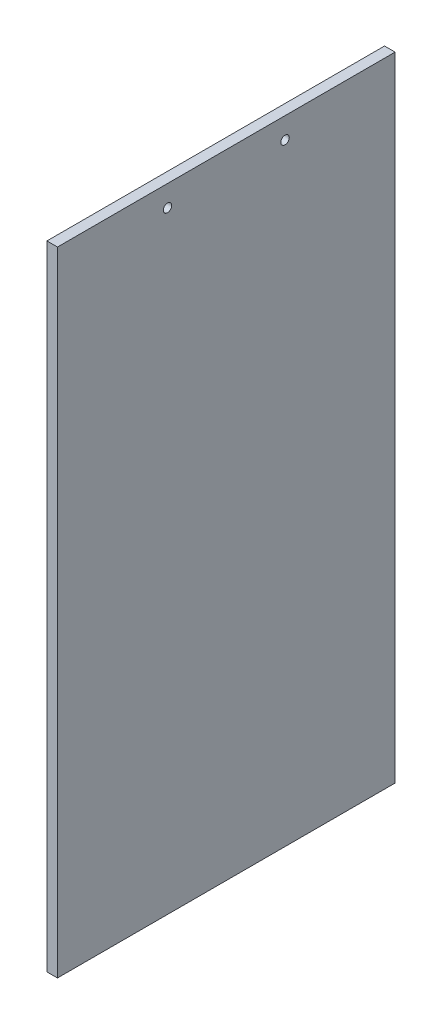
ISO-10303-21;
HEADER;
FILE_DESCRIPTION(('STEP AP214'),'2;1');
FILE_NAME('part.step','',(''),(''),'','','');
FILE_SCHEMA(('AUTOMOTIVE_DESIGN { 1 0 10303 214 1 1 1 1 }'));
ENDSEC;
DATA;
#1=APPLICATION_CONTEXT('core data for automotive mechanical design processes');
#2=APPLICATION_PROTOCOL_DEFINITION('international standard','automotive_design',2000,#1);
#3=PRODUCT_CONTEXT('',#1,'mechanical');
#4=PRODUCT('Part','Part','',(#3));
#5=PRODUCT_RELATED_PRODUCT_CATEGORY('part','',(#4));
#6=PRODUCT_DEFINITION_FORMATION('','',#4);
#7=PRODUCT_DEFINITION_CONTEXT('part definition',#1,'design');
#8=PRODUCT_DEFINITION('design','',#6,#7);
#9=PRODUCT_DEFINITION_SHAPE('','',#8);
#10=(LENGTH_UNIT() NAMED_UNIT(*) SI_UNIT(.MILLI.,.METRE.));
#11=(NAMED_UNIT(*) PLANE_ANGLE_UNIT() SI_UNIT($,.RADIAN.));
#12=(NAMED_UNIT(*) SI_UNIT($,.STERADIAN.) SOLID_ANGLE_UNIT());
#13=UNCERTAINTY_MEASURE_WITH_UNIT(LENGTH_MEASURE(1.E-05),#10,'distance_accuracy_value','');
#14=(GEOMETRIC_REPRESENTATION_CONTEXT(3) GLOBAL_UNCERTAINTY_ASSIGNED_CONTEXT((#13)) GLOBAL_UNIT_ASSIGNED_CONTEXT((#10,
#11,#12)) REPRESENTATION_CONTEXT('',''));
#15=CARTESIAN_POINT('',(0.,0.,0.));
#16=DIRECTION('',(0.,0.,1.));
#17=DIRECTION('',(1.,0.,0.));
#18=AXIS2_PLACEMENT_3D('',#15,#16,#17);
#19=CARTESIAN_POINT('',(5.,-300.,0.));
#20=DIRECTION('',(0.,1.,0.));
#21=DIRECTION('',(0.,0.,1.));
#22=AXIS2_PLACEMENT_3D('',#19,#20,#21);
#23=PLANE('',#22);
#24=DIRECTION('',(0.,0.,-1.));
#25=VECTOR('',#24,1.);
#26=CARTESIAN_POINT('',(0.,-300.,0.));
#27=LINE('',#26,#25);
#28=CARTESIAN_POINT('',(0.,-300.,-10.));
#29=VERTEX_POINT('',#28);
#30=CARTESIAN_POINT('',(0.,-300.,-170.));
#31=VERTEX_POINT('',#30);
#32=EDGE_CURVE('E93',#29,#31,#27,.T.);
#33=ORIENTED_EDGE('',*,*,#32,.T.);
#34=DIRECTION('',(1.,0.,0.));
#35=VECTOR('',#34,1.);
#36=CARTESIAN_POINT('',(-5.,-300.,-170.));
#37=LINE('',#36,#35);
#38=CARTESIAN_POINT('',(5.,-300.,-170.));
#39=VERTEX_POINT('',#38);
#40=EDGE_CURVE('E46',#31,#39,#37,.T.);
#41=ORIENTED_EDGE('',*,*,#40,.T.);
#42=DIRECTION('',(0.,0.,-1.));
#43=VECTOR('',#42,1.);
#44=CARTESIAN_POINT('',(5.,-300.,0.));
#45=LINE('',#44,#43);
#46=CARTESIAN_POINT('',(5.,-300.,-10.));
#47=VERTEX_POINT('',#46);
#48=EDGE_CURVE('E84',#47,#39,#45,.T.);
#49=ORIENTED_EDGE('',*,*,#48,.F.);
#50=DIRECTION('',(1.,0.,0.));
#51=VECTOR('',#50,1.);
#52=CARTESIAN_POINT('',(-5.,-300.,-10.));
#53=LINE('',#52,#51);
#54=EDGE_CURVE('E113',#29,#47,#53,.T.);
#55=ORIENTED_EDGE('',*,*,#54,.F.);
#56=EDGE_LOOP('',(#33,#41,#49,#55));
#57=FACE_BOUND('',#56,.T.);
#58=ADVANCED_FACE('F32',(#57),#23,.F.);
#59=CARTESIAN_POINT('',(5.,0.,0.));
#60=DIRECTION('',(0.,-1.,0.));
#61=DIRECTION('',(0.,0.,-1.));
#62=AXIS2_PLACEMENT_3D('',#59,#60,#61);
#63=PLANE('',#62);
#64=DIRECTION('',(0.,0.,1.));
#65=VECTOR('',#64,1.);
#66=CARTESIAN_POINT('',(5.,0.,0.));
#67=LINE('',#66,#65);
#68=CARTESIAN_POINT('',(5.,0.,-170.));
#69=VERTEX_POINT('',#68);
#70=CARTESIAN_POINT('',(5.,0.,-10.));
#71=VERTEX_POINT('',#70);
#72=EDGE_CURVE('E81',#69,#71,#67,.T.);
#73=ORIENTED_EDGE('',*,*,#72,.F.);
#74=DIRECTION('',(1.,0.,0.));
#75=VECTOR('',#74,1.);
#76=CARTESIAN_POINT('',(-5.,0.,-170.));
#77=LINE('',#76,#75);
#78=CARTESIAN_POINT('',(0.,0.,-170.));
#79=VERTEX_POINT('',#78);
#80=EDGE_CURVE('E70',#79,#69,#77,.T.);
#81=ORIENTED_EDGE('',*,*,#80,.F.);
#82=DIRECTION('',(0.,0.,1.));
#83=VECTOR('',#82,1.);
#84=CARTESIAN_POINT('',(0.,0.,0.));
#85=LINE('',#84,#83);
#86=CARTESIAN_POINT('',(0.,0.,-10.));
#87=VERTEX_POINT('',#86);
#88=EDGE_CURVE('E53',#79,#87,#85,.T.);
#89=ORIENTED_EDGE('',*,*,#88,.T.);
#90=DIRECTION('',(1.,0.,0.));
#91=VECTOR('',#90,1.);
#92=CARTESIAN_POINT('',(-5.,0.,-10.));
#93=LINE('',#92,#91);
#94=EDGE_CURVE('E87',#87,#71,#93,.T.);
#95=ORIENTED_EDGE('',*,*,#94,.T.);
#96=EDGE_LOOP('',(#73,#81,#89,#95));
#97=FACE_BOUND('',#96,.T.);
#98=ADVANCED_FACE('F86',(#97),#63,.F.);
#99=CARTESIAN_POINT('',(5.,0.,0.));
#100=DIRECTION('',(1.,0.,0.));
#101=DIRECTION('',(0.,0.,-1.));
#102=AXIS2_PLACEMENT_3D('',#99,#100,#101);
#103=PLANE('',#102);
#104=DIRECTION('',(0.,-1.,0.));
#105=VECTOR('',#104,1.);
#106=CARTESIAN_POINT('',(5.,0.,-170.));
#107=LINE('',#106,#105);
#108=EDGE_CURVE('E73',#69,#39,#107,.T.);
#109=ORIENTED_EDGE('',*,*,#108,.F.);
#110=ORIENTED_EDGE('',*,*,#72,.T.);
#111=DIRECTION('',(0.,1.,0.));
#112=VECTOR('',#111,1.);
#113=CARTESIAN_POINT('',(5.,0.,-10.));
#114=LINE('',#113,#112);
#115=EDGE_CURVE('E115',#47,#71,#114,.T.);
#116=ORIENTED_EDGE('',*,*,#115,.F.);
#117=ORIENTED_EDGE('',*,*,#48,.T.);
#118=EDGE_LOOP('',(#109,#110,#116,#117));
#119=FACE_BOUND('',#118,.T.);
#120=CARTESIAN_POINT('',(5.,-10.,-117.85));
#121=DIRECTION('',(1.,0.,0.));
#122=DIRECTION('',(0.,0.,-1.));
#123=AXIS2_PLACEMENT_3D('',#120,#121,#122);
#124=CIRCLE('',#123,2.);
#125=CARTESIAN_POINT('',(5.,-10.,-119.85));
#126=VERTEX_POINT('',#125);
#127=EDGE_CURVE('E110',#126,#126,#124,.T.);
#128=ORIENTED_EDGE('',*,*,#127,.F.);
#129=EDGE_LOOP('',(#128));
#130=FACE_BOUND('',#129,.T.);
#131=CARTESIAN_POINT('',(5.,-10.,-62.15));
#132=DIRECTION('',(1.,0.,0.));
#133=DIRECTION('',(0.,0.,-1.));
#134=AXIS2_PLACEMENT_3D('',#131,#132,#133);
#135=CIRCLE('',#134,2.);
#136=CARTESIAN_POINT('',(5.,-10.,-64.15));
#137=VERTEX_POINT('',#136);
#138=EDGE_CURVE('E101',#137,#137,#135,.T.);
#139=ORIENTED_EDGE('',*,*,#138,.F.);
#140=EDGE_LOOP('',(#139));
#141=FACE_BOUND('',#140,.T.);
#142=ADVANCED_FACE('F78',(#119,#130,#141),#103,.T.);
#143=CARTESIAN_POINT('',(0.,0.,0.));
#144=DIRECTION('',(1.,0.,0.));
#145=DIRECTION('',(0.,0.,-1.));
#146=AXIS2_PLACEMENT_3D('',#143,#144,#145);
#147=PLANE('',#146);
#148=CARTESIAN_POINT('',(0.,-10.,-117.85));
#149=DIRECTION('',(1.,0.,0.));
#150=DIRECTION('',(0.,0.,-1.));
#151=AXIS2_PLACEMENT_3D('',#148,#149,#150);
#152=CIRCLE('',#151,2.);
#153=CARTESIAN_POINT('',(0.,-10.,-119.85));
#154=VERTEX_POINT('',#153);
#155=EDGE_CURVE('E105',#154,#154,#152,.F.);
#156=ORIENTED_EDGE('',*,*,#155,.F.);
#157=EDGE_LOOP('',(#156));
#158=FACE_BOUND('',#157,.T.);
#159=CARTESIAN_POINT('',(0.,-10.,-62.15));
#160=DIRECTION('',(1.,0.,0.));
#161=DIRECTION('',(0.,0.,-1.));
#162=AXIS2_PLACEMENT_3D('',#159,#160,#161);
#163=CIRCLE('',#162,2.);
#164=CARTESIAN_POINT('',(0.,-10.,-64.15));
#165=VERTEX_POINT('',#164);
#166=EDGE_CURVE('E96',#165,#165,#163,.F.);
#167=ORIENTED_EDGE('',*,*,#166,.F.);
#168=EDGE_LOOP('',(#167));
#169=FACE_BOUND('',#168,.T.);
#170=ORIENTED_EDGE('',*,*,#88,.F.);
#171=DIRECTION('',(0.,-1.,0.));
#172=VECTOR('',#171,1.);
#173=CARTESIAN_POINT('',(0.,0.,-170.));
#174=LINE('',#173,#172);
#175=EDGE_CURVE('E11',#79,#31,#174,.T.);
#176=ORIENTED_EDGE('',*,*,#175,.T.);
#177=ORIENTED_EDGE('',*,*,#32,.F.);
#178=DIRECTION('',(0.,1.,0.));
#179=VECTOR('',#178,1.);
#180=CARTESIAN_POINT('',(0.,0.,-10.));
#181=LINE('',#180,#179);
#182=EDGE_CURVE('E39',#29,#87,#181,.T.);
#183=ORIENTED_EDGE('',*,*,#182,.T.);
#184=EDGE_LOOP('',(#170,#176,#177,#183));
#185=FACE_BOUND('',#184,.T.);
#186=ADVANCED_FACE('F120',(#158,#169,#185),#147,.F.);
#187=CARTESIAN_POINT('',(-0.00100000000000013,-10.,-62.15));
#188=DIRECTION('',(1.,0.,0.));
#189=DIRECTION('',(0.,0.,-1.));
#190=AXIS2_PLACEMENT_3D('',#187,#188,#189);
#191=CYLINDRICAL_SURFACE('',#190,2.);
#192=ORIENTED_EDGE('',*,*,#138,.T.);
#193=EDGE_LOOP('',(#192));
#194=FACE_BOUND('',#193,.T.);
#195=ORIENTED_EDGE('',*,*,#166,.T.);
#196=EDGE_LOOP('',(#195));
#197=FACE_BOUND('',#196,.T.);
#198=ADVANCED_FACE('F130',(#194,#197),#191,.F.);
#199=CARTESIAN_POINT('',(-0.00100000000000013,-10.,-117.85));
#200=DIRECTION('',(1.,0.,0.));
#201=DIRECTION('',(0.,0.,-1.));
#202=AXIS2_PLACEMENT_3D('',#199,#200,#201);
#203=CYLINDRICAL_SURFACE('',#202,2.);
#204=ORIENTED_EDGE('',*,*,#127,.T.);
#205=EDGE_LOOP('',(#204));
#206=FACE_BOUND('',#205,.T.);
#207=ORIENTED_EDGE('',*,*,#155,.T.);
#208=EDGE_LOOP('',(#207));
#209=FACE_BOUND('',#208,.T.);
#210=ADVANCED_FACE('F123',(#206,#209),#203,.F.);
#211=CARTESIAN_POINT('',(-5.,0.,-10.));
#212=DIRECTION('',(0.,0.,-1.));
#213=DIRECTION('',(0.,1.,0.));
#214=AXIS2_PLACEMENT_3D('',#211,#212,#213);
#215=PLANE('',#214);
#216=ORIENTED_EDGE('',*,*,#54,.T.);
#217=ORIENTED_EDGE('',*,*,#115,.T.);
#218=ORIENTED_EDGE('',*,*,#94,.F.);
#219=ORIENTED_EDGE('',*,*,#182,.F.);
#220=EDGE_LOOP('',(#216,#217,#218,#219));
#221=FACE_BOUND('',#220,.T.);
#222=ADVANCED_FACE('F121',(#221),#215,.F.);
#223=CARTESIAN_POINT('',(-5.,0.,-170.));
#224=DIRECTION('',(0.,0.,1.));
#225=DIRECTION('',(0.,-1.,0.));
#226=AXIS2_PLACEMENT_3D('',#223,#224,#225);
#227=PLANE('',#226);
#228=ORIENTED_EDGE('',*,*,#80,.T.);
#229=ORIENTED_EDGE('',*,*,#108,.T.);
#230=ORIENTED_EDGE('',*,*,#40,.F.);
#231=ORIENTED_EDGE('',*,*,#175,.F.);
#232=EDGE_LOOP('',(#228,#229,#230,#231));
#233=FACE_BOUND('',#232,.T.);
#234=ADVANCED_FACE('F72',(#233),#227,.F.);
#235=CLOSED_SHELL('',(#58,#98,#142,#186,#198,#210,#222,#234));
#236=MANIFOLD_SOLID_BREP('B2',#235);
#237=ADVANCED_BREP_SHAPE_REPRESENTATION('',(#18,#236),#14);
#238=SHAPE_DEFINITION_REPRESENTATION(#9,#237);
ENDSEC;
END-ISO-10303-21;
